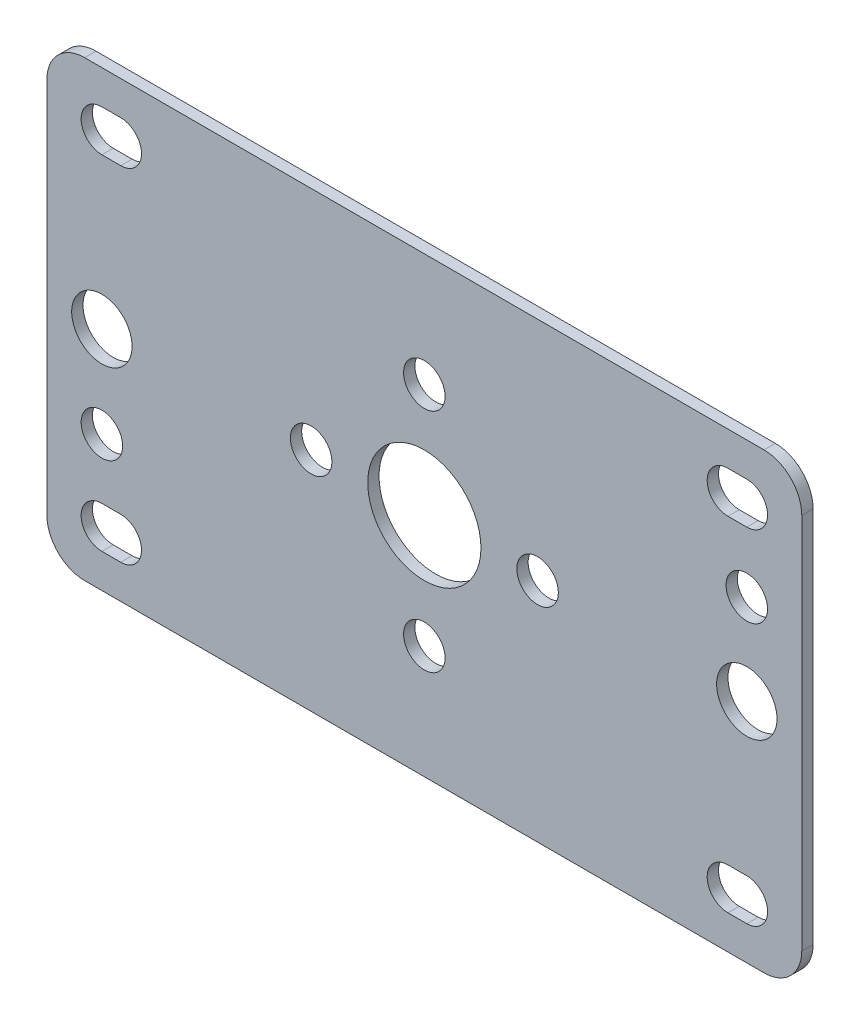
ISO-10303-21;
HEADER;
FILE_DESCRIPTION(('STEP AP214'),'2;1');
FILE_NAME('part.step','',(''),(''),'','','');
FILE_SCHEMA(('AUTOMOTIVE_DESIGN { 1 0 10303 214 1 1 1 1 }'));
ENDSEC;
DATA;
#1=APPLICATION_CONTEXT('core data for automotive mechanical design processes');
#2=APPLICATION_PROTOCOL_DEFINITION('international standard','automotive_design',2000,#1);
#3=PRODUCT_CONTEXT('',#1,'mechanical');
#4=PRODUCT('Part','Part','',(#3));
#5=PRODUCT_RELATED_PRODUCT_CATEGORY('part','',(#4));
#6=PRODUCT_DEFINITION_FORMATION('','',#4);
#7=PRODUCT_DEFINITION_CONTEXT('part definition',#1,'design');
#8=PRODUCT_DEFINITION('design','',#6,#7);
#9=PRODUCT_DEFINITION_SHAPE('','',#8);
#10=(LENGTH_UNIT() NAMED_UNIT(*) SI_UNIT(.MILLI.,.METRE.));
#11=(NAMED_UNIT(*) PLANE_ANGLE_UNIT() SI_UNIT($,.RADIAN.));
#12=(NAMED_UNIT(*) SI_UNIT($,.STERADIAN.) SOLID_ANGLE_UNIT());
#13=UNCERTAINTY_MEASURE_WITH_UNIT(LENGTH_MEASURE(1.E-05),#10,'distance_accuracy_value','');
#14=(GEOMETRIC_REPRESENTATION_CONTEXT(3) GLOBAL_UNCERTAINTY_ASSIGNED_CONTEXT((#13)) GLOBAL_UNIT_ASSIGNED_CONTEXT((#10,
#11,#12)) REPRESENTATION_CONTEXT('',''));
#15=CARTESIAN_POINT('',(0.,0.,0.));
#16=DIRECTION('',(0.,0.,1.));
#17=DIRECTION('',(1.,0.,0.));
#18=AXIS2_PLACEMENT_3D('',#15,#16,#17);
#19=CARTESIAN_POINT('',(0.,0.,0.));
#20=DIRECTION('',(0.,0.,1.));
#21=DIRECTION('',(1.,0.,0.));
#22=AXIS2_PLACEMENT_3D('',#19,#20,#21);
#23=PLANE('',#22);
#24=CARTESIAN_POINT('',(42.72,-22.75,0.));
#25=DIRECTION('',(0.,0.,1.));
#26=DIRECTION('',(1.,0.,0.));
#27=AXIS2_PLACEMENT_3D('',#24,#25,#26);
#28=CIRCLE('',#27,2.75);
#29=CARTESIAN_POINT('',(42.72,-20.,0.));
#30=VERTEX_POINT('',#29);
#31=CARTESIAN_POINT('',(42.72,-25.5,0.));
#32=VERTEX_POINT('',#31);
#33=EDGE_CURVE('E201',#30,#32,#28,.F.);
#34=ORIENTED_EDGE('',*,*,#33,.T.);
#35=DIRECTION('',(1.,0.,0.));
#36=VECTOR('',#35,1.);
#37=CARTESIAN_POINT('',(42.72,-25.5,0.));
#38=LINE('',#37,#36);
#39=CARTESIAN_POINT('',(40.22,-25.5,0.));
#40=VERTEX_POINT('',#39);
#41=EDGE_CURVE('E203',#40,#32,#38,.T.);
#42=ORIENTED_EDGE('',*,*,#41,.F.);
#43=CARTESIAN_POINT('',(40.22,-22.75,0.));
#44=DIRECTION('',(0.,0.,1.));
#45=DIRECTION('',(1.,0.,0.));
#46=AXIS2_PLACEMENT_3D('',#43,#44,#45);
#47=CIRCLE('',#46,2.75);
#48=CARTESIAN_POINT('',(40.22,-20.,0.));
#49=VERTEX_POINT('',#48);
#50=EDGE_CURVE('E205',#40,#49,#47,.F.);
#51=ORIENTED_EDGE('',*,*,#50,.T.);
#52=DIRECTION('',(1.,0.,0.));
#53=VECTOR('',#52,1.);
#54=CARTESIAN_POINT('',(40.22,-20.,0.));
#55=LINE('',#54,#53);
#56=EDGE_CURVE('E198',#30,#49,#55,.F.);
#57=ORIENTED_EDGE('',*,*,#56,.F.);
#58=EDGE_LOOP('',(#34,#42,#51,#57));
#59=FACE_BOUND('',#58,.T.);
#60=DIRECTION('',(1.,0.,0.));
#61=VECTOR('',#60,1.);
#62=CARTESIAN_POINT('',(-40.22,-25.5,0.));
#63=LINE('',#62,#61);
#64=CARTESIAN_POINT('',(-42.72,-25.5,0.));
#65=VERTEX_POINT('',#64);
#66=CARTESIAN_POINT('',(-40.22,-25.5,0.));
#67=VERTEX_POINT('',#66);
#68=EDGE_CURVE('E206',#65,#67,#63,.T.);
#69=ORIENTED_EDGE('',*,*,#68,.F.);
#70=CARTESIAN_POINT('',(-42.72,-22.75,0.));
#71=DIRECTION('',(0.,0.,1.));
#72=DIRECTION('',(1.,0.,0.));
#73=AXIS2_PLACEMENT_3D('',#70,#71,#72);
#74=CIRCLE('',#73,2.75);
#75=CARTESIAN_POINT('',(-42.72,-20.,0.));
#76=VERTEX_POINT('',#75);
#77=EDGE_CURVE('E321',#65,#76,#74,.F.);
#78=ORIENTED_EDGE('',*,*,#77,.T.);
#79=DIRECTION('',(1.,0.,0.));
#80=VECTOR('',#79,1.);
#81=CARTESIAN_POINT('',(-42.72,-20.,0.));
#82=LINE('',#81,#80);
#83=CARTESIAN_POINT('',(-40.22,-20.,0.));
#84=VERTEX_POINT('',#83);
#85=EDGE_CURVE('E210',#84,#76,#82,.F.);
#86=ORIENTED_EDGE('',*,*,#85,.F.);
#87=CARTESIAN_POINT('',(-40.22,-22.75,0.));
#88=DIRECTION('',(0.,0.,1.));
#89=DIRECTION('',(1.,0.,0.));
#90=AXIS2_PLACEMENT_3D('',#87,#88,#89);
#91=CIRCLE('',#90,2.75);
#92=EDGE_CURVE('E213',#84,#67,#91,.F.);
#93=ORIENTED_EDGE('',*,*,#92,.T.);
#94=EDGE_LOOP('',(#69,#78,#86,#93));
#95=FACE_BOUND('',#94,.T.);
#96=CARTESIAN_POINT('',(-42.72,22.75,0.));
#97=DIRECTION('',(0.,0.,1.));
#98=DIRECTION('',(1.,0.,0.));
#99=AXIS2_PLACEMENT_3D('',#96,#97,#98);
#100=CIRCLE('',#99,2.75);
#101=CARTESIAN_POINT('',(-42.72,20.,0.));
#102=VERTEX_POINT('',#101);
#103=CARTESIAN_POINT('',(-42.72,25.5,0.));
#104=VERTEX_POINT('',#103);
#105=EDGE_CURVE('E218',#102,#104,#100,.F.);
#106=ORIENTED_EDGE('',*,*,#105,.T.);
#107=DIRECTION('',(1.,0.,0.));
#108=VECTOR('',#107,1.);
#109=CARTESIAN_POINT('',(-42.72,25.5,0.));
#110=LINE('',#109,#108);
#111=CARTESIAN_POINT('',(-40.22,25.5,0.));
#112=VERTEX_POINT('',#111);
#113=EDGE_CURVE('E220',#112,#104,#110,.F.);
#114=ORIENTED_EDGE('',*,*,#113,.F.);
#115=CARTESIAN_POINT('',(-40.22,22.75,0.));
#116=DIRECTION('',(0.,0.,1.));
#117=DIRECTION('',(1.,0.,0.));
#118=AXIS2_PLACEMENT_3D('',#115,#116,#117);
#119=CIRCLE('',#118,2.75);
#120=CARTESIAN_POINT('',(-40.22,20.,0.));
#121=VERTEX_POINT('',#120);
#122=EDGE_CURVE('E222',#112,#121,#119,.F.);
#123=ORIENTED_EDGE('',*,*,#122,.T.);
#124=DIRECTION('',(1.,0.,0.));
#125=VECTOR('',#124,1.);
#126=CARTESIAN_POINT('',(-40.22,20.,0.));
#127=LINE('',#126,#125);
#128=EDGE_CURVE('E215',#102,#121,#127,.T.);
#129=ORIENTED_EDGE('',*,*,#128,.F.);
#130=EDGE_LOOP('',(#106,#114,#123,#129));
#131=FACE_BOUND('',#130,.T.);
#132=DIRECTION('',(1.,0.,0.));
#133=VECTOR('',#132,1.);
#134=CARTESIAN_POINT('',(40.22,25.5,0.));
#135=LINE('',#134,#133);
#136=CARTESIAN_POINT('',(42.72,25.5,0.));
#137=VERTEX_POINT('',#136);
#138=CARTESIAN_POINT('',(40.22,25.5,0.));
#139=VERTEX_POINT('',#138);
#140=EDGE_CURVE('E223',#137,#139,#135,.F.);
#141=ORIENTED_EDGE('',*,*,#140,.F.);
#142=CARTESIAN_POINT('',(42.72,22.75,0.));
#143=DIRECTION('',(0.,0.,1.));
#144=DIRECTION('',(1.,0.,0.));
#145=AXIS2_PLACEMENT_3D('',#142,#143,#144);
#146=CIRCLE('',#145,2.75);
#147=CARTESIAN_POINT('',(42.72,20.,0.));
#148=VERTEX_POINT('',#147);
#149=EDGE_CURVE('E331',#137,#148,#146,.F.);
#150=ORIENTED_EDGE('',*,*,#149,.T.);
#151=DIRECTION('',(1.,0.,0.));
#152=VECTOR('',#151,1.);
#153=CARTESIAN_POINT('',(42.72,20.,0.));
#154=LINE('',#153,#152);
#155=CARTESIAN_POINT('',(40.22,20.,0.));
#156=VERTEX_POINT('',#155);
#157=EDGE_CURVE('E227',#156,#148,#154,.T.);
#158=ORIENTED_EDGE('',*,*,#157,.F.);
#159=CARTESIAN_POINT('',(40.22,22.75,0.));
#160=DIRECTION('',(0.,0.,1.));
#161=DIRECTION('',(1.,0.,0.));
#162=AXIS2_PLACEMENT_3D('',#159,#160,#161);
#163=CIRCLE('',#162,2.75);
#164=EDGE_CURVE('E229',#156,#139,#163,.F.);
#165=ORIENTED_EDGE('',*,*,#164,.T.);
#166=EDGE_LOOP('',(#141,#150,#158,#165));
#167=FACE_BOUND('',#166,.T.);
#168=CARTESIAN_POINT('',(42.72,0.,0.));
#169=DIRECTION('',(0.,0.,1.));
#170=DIRECTION('',(1.,0.,0.));
#171=AXIS2_PLACEMENT_3D('',#168,#169,#170);
#172=CIRCLE('',#171,4.);
#173=CARTESIAN_POINT('',(46.72,0.,0.));
#174=VERTEX_POINT('',#173);
#175=EDGE_CURVE('E333',#174,#174,#172,.F.);
#176=ORIENTED_EDGE('',*,*,#175,.T.);
#177=EDGE_LOOP('',(#176));
#178=FACE_BOUND('',#177,.T.);
#179=CARTESIAN_POINT('',(0.,0.,0.));
#180=DIRECTION('',(0.,0.,1.));
#181=DIRECTION('',(1.,0.,0.));
#182=AXIS2_PLACEMENT_3D('',#179,#180,#181);
#183=CIRCLE('',#182,7.5);
#184=CARTESIAN_POINT('',(7.5,0.,0.));
#185=VERTEX_POINT('',#184);
#186=EDGE_CURVE('E336',#185,#185,#183,.F.);
#187=ORIENTED_EDGE('',*,*,#186,.T.);
#188=EDGE_LOOP('',(#187));
#189=FACE_BOUND('',#188,.T.);
#190=CARTESIAN_POINT('',(0.,-15.,0.));
#191=DIRECTION('',(0.,0.,1.));
#192=DIRECTION('',(1.,0.,0.));
#193=AXIS2_PLACEMENT_3D('',#190,#191,#192);
#194=CIRCLE('',#193,2.75);
#195=CARTESIAN_POINT('',(2.75,-15.,0.));
#196=VERTEX_POINT('',#195);
#197=EDGE_CURVE('E339',#196,#196,#194,.F.);
#198=ORIENTED_EDGE('',*,*,#197,.T.);
#199=EDGE_LOOP('',(#198));
#200=FACE_BOUND('',#199,.T.);
#201=CARTESIAN_POINT('',(-15.,0.,0.));
#202=DIRECTION('',(0.,0.,1.));
#203=DIRECTION('',(1.,0.,0.));
#204=AXIS2_PLACEMENT_3D('',#201,#202,#203);
#205=CIRCLE('',#204,2.75);
#206=CARTESIAN_POINT('',(-12.25,0.,0.));
#207=VERTEX_POINT('',#206);
#208=EDGE_CURVE('E342',#207,#207,#205,.F.);
#209=ORIENTED_EDGE('',*,*,#208,.T.);
#210=EDGE_LOOP('',(#209));
#211=FACE_BOUND('',#210,.T.);
#212=CARTESIAN_POINT('',(0.,15.,0.));
#213=DIRECTION('',(0.,0.,1.));
#214=DIRECTION('',(1.,0.,0.));
#215=AXIS2_PLACEMENT_3D('',#212,#213,#214);
#216=CIRCLE('',#215,2.75);
#217=CARTESIAN_POINT('',(2.75000000000001,15.,0.));
#218=VERTEX_POINT('',#217);
#219=EDGE_CURVE('E345',#218,#218,#216,.F.);
#220=ORIENTED_EDGE('',*,*,#219,.T.);
#221=EDGE_LOOP('',(#220));
#222=FACE_BOUND('',#221,.T.);
#223=CARTESIAN_POINT('',(15.,0.,0.));
#224=DIRECTION('',(0.,0.,1.));
#225=DIRECTION('',(1.,0.,0.));
#226=AXIS2_PLACEMENT_3D('',#223,#224,#225);
#227=CIRCLE('',#226,2.75);
#228=CARTESIAN_POINT('',(17.75,0.,0.));
#229=VERTEX_POINT('',#228);
#230=EDGE_CURVE('E348',#229,#229,#227,.F.);
#231=ORIENTED_EDGE('',*,*,#230,.T.);
#232=EDGE_LOOP('',(#231));
#233=FACE_BOUND('',#232,.T.);
#234=CARTESIAN_POINT('',(-42.72,-12.05,0.));
#235=DIRECTION('',(0.,0.,1.));
#236=DIRECTION('',(1.,0.,0.));
#237=AXIS2_PLACEMENT_3D('',#234,#235,#236);
#238=CIRCLE('',#237,2.75);
#239=CARTESIAN_POINT('',(-39.97,-12.05,0.));
#240=VERTEX_POINT('',#239);
#241=EDGE_CURVE('E351',#240,#240,#238,.F.);
#242=ORIENTED_EDGE('',*,*,#241,.T.);
#243=EDGE_LOOP('',(#242));
#244=FACE_BOUND('',#243,.T.);
#245=CARTESIAN_POINT('',(42.72,11.97,0.));
#246=DIRECTION('',(0.,0.,1.));
#247=DIRECTION('',(1.,0.,0.));
#248=AXIS2_PLACEMENT_3D('',#245,#246,#247);
#249=CIRCLE('',#248,2.75);
#250=CARTESIAN_POINT('',(45.47,11.97,0.));
#251=VERTEX_POINT('',#250);
#252=EDGE_CURVE('E354',#251,#251,#249,.F.);
#253=ORIENTED_EDGE('',*,*,#252,.T.);
#254=EDGE_LOOP('',(#253));
#255=FACE_BOUND('',#254,.T.);
#256=CARTESIAN_POINT('',(-42.72,0.,0.));
#257=DIRECTION('',(0.,0.,1.));
#258=DIRECTION('',(1.,0.,0.));
#259=AXIS2_PLACEMENT_3D('',#256,#257,#258);
#260=CIRCLE('',#259,4.);
#261=CARTESIAN_POINT('',(-38.72,0.,0.));
#262=VERTEX_POINT('',#261);
#263=EDGE_CURVE('E357',#262,#262,#260,.F.);
#264=ORIENTED_EDGE('',*,*,#263,.T.);
#265=EDGE_LOOP('',(#264));
#266=FACE_BOUND('',#265,.T.);
#267=CARTESIAN_POINT('',(45.,25.,0.));
#268=DIRECTION('',(0.,0.,1.));
#269=DIRECTION('',(1.,0.,0.));
#270=AXIS2_PLACEMENT_3D('',#267,#268,#269);
#271=CIRCLE('',#270,5.);
#272=CARTESIAN_POINT('',(45.,30.,0.));
#273=VERTEX_POINT('',#272);
#274=CARTESIAN_POINT('',(50.,25.,0.));
#275=VERTEX_POINT('',#274);
#276=EDGE_CURVE('E178',#273,#275,#271,.F.);
#277=ORIENTED_EDGE('',*,*,#276,.F.);
#278=DIRECTION('',(1.,0.,0.));
#279=VECTOR('',#278,1.);
#280=CARTESIAN_POINT('',(45.,30.,0.));
#281=LINE('',#280,#279);
#282=CARTESIAN_POINT('',(-45.,30.,0.));
#283=VERTEX_POINT('',#282);
#284=EDGE_CURVE('E176',#283,#273,#281,.T.);
#285=ORIENTED_EDGE('',*,*,#284,.F.);
#286=CARTESIAN_POINT('',(-45.,25.,0.));
#287=DIRECTION('',(0.,0.,1.));
#288=DIRECTION('',(1.,0.,0.));
#289=AXIS2_PLACEMENT_3D('',#286,#287,#288);
#290=CIRCLE('',#289,5.);
#291=CARTESIAN_POINT('',(-50.,25.,0.));
#292=VERTEX_POINT('',#291);
#293=EDGE_CURVE('E20',#292,#283,#290,.F.);
#294=ORIENTED_EDGE('',*,*,#293,.F.);
#295=DIRECTION('',(0.,1.,0.));
#296=VECTOR('',#295,1.);
#297=CARTESIAN_POINT('',(-50.,25.,0.));
#298=LINE('',#297,#296);
#299=CARTESIAN_POINT('',(-50.,-25.,0.));
#300=VERTEX_POINT('',#299);
#301=EDGE_CURVE('E242',#300,#292,#298,.T.);
#302=ORIENTED_EDGE('',*,*,#301,.F.);
#303=CARTESIAN_POINT('',(-45.,-25.,0.));
#304=DIRECTION('',(0.,0.,1.));
#305=DIRECTION('',(1.,0.,0.));
#306=AXIS2_PLACEMENT_3D('',#303,#304,#305);
#307=CIRCLE('',#306,5.);
#308=CARTESIAN_POINT('',(-45.,-30.,0.));
#309=VERTEX_POINT('',#308);
#310=EDGE_CURVE('E364',#309,#300,#307,.F.);
#311=ORIENTED_EDGE('',*,*,#310,.F.);
#312=DIRECTION('',(1.,0.,0.));
#313=VECTOR('',#312,1.);
#314=CARTESIAN_POINT('',(-45.,-30.,0.));
#315=LINE('',#314,#313);
#316=CARTESIAN_POINT('',(45.,-30.,0.));
#317=VERTEX_POINT('',#316);
#318=EDGE_CURVE('E237',#317,#309,#315,.F.);
#319=ORIENTED_EDGE('',*,*,#318,.F.);
#320=CARTESIAN_POINT('',(45.,-25.,0.));
#321=DIRECTION('',(0.,0.,1.));
#322=DIRECTION('',(1.,0.,0.));
#323=AXIS2_PLACEMENT_3D('',#320,#321,#322);
#324=CIRCLE('',#323,5.);
#325=CARTESIAN_POINT('',(50.,-25.,0.));
#326=VERTEX_POINT('',#325);
#327=EDGE_CURVE('E362',#326,#317,#324,.F.);
#328=ORIENTED_EDGE('',*,*,#327,.F.);
#329=DIRECTION('',(0.,1.,0.));
#330=VECTOR('',#329,1.);
#331=CARTESIAN_POINT('',(50.,-25.,0.));
#332=LINE('',#331,#330);
#333=EDGE_CURVE('E232',#275,#326,#332,.F.);
#334=ORIENTED_EDGE('',*,*,#333,.F.);
#335=EDGE_LOOP('',(#277,#285,#294,#302,#311,#319,#328,#334));
#336=FACE_BOUND('',#335,.T.);
#337=ADVANCED_FACE('F17',(#59,#95,#131,#167,#178,#189,#200,#211,#222,#233,#244,#255,#266,#336),
#23,.T.);
#338=CARTESIAN_POINT('',(45.,30.,0.));
#339=DIRECTION('',(0.,1.,0.));
#340=DIRECTION('',(0.,0.,1.));
#341=AXIS2_PLACEMENT_3D('',#338,#339,#340);
#342=PLANE('',#341);
#343=DIRECTION('',(0.,0.,1.));
#344=VECTOR('',#343,1.);
#345=CARTESIAN_POINT('',(-45.,30.,0.));
#346=LINE('',#345,#344);
#347=CARTESIAN_POINT('',(-45.,30.,-1.5));
#348=VERTEX_POINT('',#347);
#349=EDGE_CURVE('E183',#283,#348,#346,.F.);
#350=ORIENTED_EDGE('',*,*,#349,.F.);
#351=ORIENTED_EDGE('',*,*,#284,.T.);
#352=DIRECTION('',(0.,0.,1.));
#353=VECTOR('',#352,1.);
#354=CARTESIAN_POINT('',(45.,30.,0.));
#355=LINE('',#354,#353);
#356=CARTESIAN_POINT('',(45.,30.,-1.5));
#357=VERTEX_POINT('',#356);
#358=EDGE_CURVE('E361',#357,#273,#355,.T.);
#359=ORIENTED_EDGE('',*,*,#358,.F.);
#360=DIRECTION('',(1.,0.,0.));
#361=VECTOR('',#360,1.);
#362=CARTESIAN_POINT('',(0.,30.,-1.5));
#363=LINE('',#362,#361);
#364=EDGE_CURVE('E193',#357,#348,#363,.F.);
#365=ORIENTED_EDGE('',*,*,#364,.T.);
#366=EDGE_LOOP('',(#350,#351,#359,#365));
#367=FACE_BOUND('',#366,.T.);
#368=ADVANCED_FACE('F192',(#367),#342,.T.);
#369=CARTESIAN_POINT('',(-45.,25.,0.));
#370=DIRECTION('',(0.,0.,1.));
#371=DIRECTION('',(1.,0.,0.));
#372=AXIS2_PLACEMENT_3D('',#369,#370,#371);
#373=CYLINDRICAL_SURFACE('',#372,5.);
#374=DIRECTION('',(0.,0.,1.));
#375=VECTOR('',#374,1.);
#376=CARTESIAN_POINT('',(-50.,25.,0.));
#377=LINE('',#376,#375);
#378=CARTESIAN_POINT('',(-50.,25.,-1.5));
#379=VERTEX_POINT('',#378);
#380=EDGE_CURVE('E190',#292,#379,#377,.F.);
#381=ORIENTED_EDGE('',*,*,#380,.F.);
#382=ORIENTED_EDGE('',*,*,#293,.T.);
#383=ORIENTED_EDGE('',*,*,#349,.T.);
#384=CARTESIAN_POINT('',(-45.,25.,-1.5));
#385=DIRECTION('',(0.,0.,1.));
#386=DIRECTION('',(1.,0.,0.));
#387=AXIS2_PLACEMENT_3D('',#384,#385,#386);
#388=CIRCLE('',#387,5.);
#389=EDGE_CURVE('E312',#348,#379,#388,.T.);
#390=ORIENTED_EDGE('',*,*,#389,.T.);
#391=EDGE_LOOP('',(#381,#382,#383,#390));
#392=FACE_BOUND('',#391,.T.);
#393=ADVANCED_FACE('F187',(#392),#373,.T.);
#394=CARTESIAN_POINT('',(-50.,25.,0.));
#395=DIRECTION('',(-1.,0.,0.));
#396=DIRECTION('',(0.,0.,1.));
#397=AXIS2_PLACEMENT_3D('',#394,#395,#396);
#398=PLANE('',#397);
#399=DIRECTION('',(0.,0.,1.));
#400=VECTOR('',#399,1.);
#401=CARTESIAN_POINT('',(-50.,-25.,0.));
#402=LINE('',#401,#400);
#403=CARTESIAN_POINT('',(-50.,-25.,-1.5));
#404=VERTEX_POINT('',#403);
#405=EDGE_CURVE('E243',#300,#404,#402,.F.);
#406=ORIENTED_EDGE('',*,*,#405,.F.);
#407=ORIENTED_EDGE('',*,*,#301,.T.);
#408=ORIENTED_EDGE('',*,*,#380,.T.);
#409=DIRECTION('',(0.,1.,0.));
#410=VECTOR('',#409,1.);
#411=CARTESIAN_POINT('',(-50.,0.,-1.5));
#412=LINE('',#411,#410);
#413=EDGE_CURVE('E311',#379,#404,#412,.F.);
#414=ORIENTED_EDGE('',*,*,#413,.T.);
#415=EDGE_LOOP('',(#406,#407,#408,#414));
#416=FACE_BOUND('',#415,.T.);
#417=ADVANCED_FACE('F557',(#416),#398,.T.);
#418=CARTESIAN_POINT('',(-45.,-25.,0.));
#419=DIRECTION('',(0.,0.,1.));
#420=DIRECTION('',(1.,0.,0.));
#421=AXIS2_PLACEMENT_3D('',#418,#419,#420);
#422=CYLINDRICAL_SURFACE('',#421,5.);
#423=DIRECTION('',(0.,0.,-1.));
#424=VECTOR('',#423,1.);
#425=CARTESIAN_POINT('',(-45.,-30.,0.));
#426=LINE('',#425,#424);
#427=CARTESIAN_POINT('',(-45.,-30.,-1.5));
#428=VERTEX_POINT('',#427);
#429=EDGE_CURVE('E241',#309,#428,#426,.T.);
#430=ORIENTED_EDGE('',*,*,#429,.F.);
#431=ORIENTED_EDGE('',*,*,#310,.T.);
#432=ORIENTED_EDGE('',*,*,#405,.T.);
#433=CARTESIAN_POINT('',(-45.,-25.,-1.5));
#434=DIRECTION('',(0.,0.,1.));
#435=DIRECTION('',(1.,0.,0.));
#436=AXIS2_PLACEMENT_3D('',#433,#434,#435);
#437=CIRCLE('',#436,5.);
#438=EDGE_CURVE('E308',#404,#428,#437,.T.);
#439=ORIENTED_EDGE('',*,*,#438,.T.);
#440=EDGE_LOOP('',(#430,#431,#432,#439));
#441=FACE_BOUND('',#440,.T.);
#442=ADVANCED_FACE('F553',(#441),#422,.T.);
#443=CARTESIAN_POINT('',(-45.,-30.,0.));
#444=DIRECTION('',(0.,-1.,0.));
#445=DIRECTION('',(0.,0.,-1.));
#446=AXIS2_PLACEMENT_3D('',#443,#444,#445);
#447=PLANE('',#446);
#448=DIRECTION('',(0.,0.,1.));
#449=VECTOR('',#448,1.);
#450=CARTESIAN_POINT('',(45.,-30.,0.));
#451=LINE('',#450,#449);
#452=CARTESIAN_POINT('',(45.,-30.,-1.5));
#453=VERTEX_POINT('',#452);
#454=EDGE_CURVE('E240',#317,#453,#451,.F.);
#455=ORIENTED_EDGE('',*,*,#454,.F.);
#456=ORIENTED_EDGE('',*,*,#318,.T.);
#457=ORIENTED_EDGE('',*,*,#429,.T.);
#458=DIRECTION('',(1.,0.,0.));
#459=VECTOR('',#458,1.);
#460=CARTESIAN_POINT('',(0.,-30.,-1.5));
#461=LINE('',#460,#459);
#462=EDGE_CURVE('E307',#428,#453,#461,.T.);
#463=ORIENTED_EDGE('',*,*,#462,.T.);
#464=EDGE_LOOP('',(#455,#456,#457,#463));
#465=FACE_BOUND('',#464,.T.);
#466=ADVANCED_FACE('F549',(#465),#447,.T.);
#467=CARTESIAN_POINT('',(45.,-25.,0.));
#468=DIRECTION('',(0.,0.,1.));
#469=DIRECTION('',(1.,0.,0.));
#470=AXIS2_PLACEMENT_3D('',#467,#468,#469);
#471=CYLINDRICAL_SURFACE('',#470,5.);
#472=DIRECTION('',(0.,0.,-1.));
#473=VECTOR('',#472,1.);
#474=CARTESIAN_POINT('',(50.,-25.,0.));
#475=LINE('',#474,#473);
#476=CARTESIAN_POINT('',(50.,-25.,-1.5));
#477=VERTEX_POINT('',#476);
#478=EDGE_CURVE('E236',#326,#477,#475,.T.);
#479=ORIENTED_EDGE('',*,*,#478,.F.);
#480=ORIENTED_EDGE('',*,*,#327,.T.);
#481=ORIENTED_EDGE('',*,*,#454,.T.);
#482=CARTESIAN_POINT('',(45.,-25.,-1.5));
#483=DIRECTION('',(0.,0.,1.));
#484=DIRECTION('',(1.,0.,0.));
#485=AXIS2_PLACEMENT_3D('',#482,#483,#484);
#486=CIRCLE('',#485,5.);
#487=EDGE_CURVE('E304',#453,#477,#486,.T.);
#488=ORIENTED_EDGE('',*,*,#487,.T.);
#489=EDGE_LOOP('',(#479,#480,#481,#488));
#490=FACE_BOUND('',#489,.T.);
#491=ADVANCED_FACE('F545',(#490),#471,.T.);
#492=CARTESIAN_POINT('',(50.,-25.,0.));
#493=DIRECTION('',(1.,0.,0.));
#494=DIRECTION('',(0.,0.,-1.));
#495=AXIS2_PLACEMENT_3D('',#492,#493,#494);
#496=PLANE('',#495);
#497=DIRECTION('',(0.,0.,1.));
#498=VECTOR('',#497,1.);
#499=CARTESIAN_POINT('',(50.,25.,0.));
#500=LINE('',#499,#498);
#501=CARTESIAN_POINT('',(50.,25.,-1.5));
#502=VERTEX_POINT('',#501);
#503=EDGE_CURVE('E235',#275,#502,#500,.F.);
#504=ORIENTED_EDGE('',*,*,#503,.F.);
#505=ORIENTED_EDGE('',*,*,#333,.T.);
#506=ORIENTED_EDGE('',*,*,#478,.T.);
#507=DIRECTION('',(0.,1.,0.));
#508=VECTOR('',#507,1.);
#509=CARTESIAN_POINT('',(50.,0.,-1.5));
#510=LINE('',#509,#508);
#511=EDGE_CURVE('E303',#477,#502,#510,.T.);
#512=ORIENTED_EDGE('',*,*,#511,.T.);
#513=EDGE_LOOP('',(#504,#505,#506,#512));
#514=FACE_BOUND('',#513,.T.);
#515=ADVANCED_FACE('F541',(#514),#496,.T.);
#516=CARTESIAN_POINT('',(45.,25.,0.));
#517=DIRECTION('',(0.,0.,1.));
#518=DIRECTION('',(1.,0.,0.));
#519=AXIS2_PLACEMENT_3D('',#516,#517,#518);
#520=CYLINDRICAL_SURFACE('',#519,5.);
#521=ORIENTED_EDGE('',*,*,#358,.T.);
#522=ORIENTED_EDGE('',*,*,#276,.T.);
#523=ORIENTED_EDGE('',*,*,#503,.T.);
#524=CARTESIAN_POINT('',(45.,25.,-1.5));
#525=DIRECTION('',(0.,0.,1.));
#526=DIRECTION('',(1.,0.,0.));
#527=AXIS2_PLACEMENT_3D('',#524,#525,#526);
#528=CIRCLE('',#527,5.);
#529=EDGE_CURVE('E300',#502,#357,#528,.T.);
#530=ORIENTED_EDGE('',*,*,#529,.T.);
#531=EDGE_LOOP('',(#521,#522,#523,#530));
#532=FACE_BOUND('',#531,.T.);
#533=ADVANCED_FACE('F537',(#532),#520,.T.);
#534=CARTESIAN_POINT('',(-42.72,0.,0.));
#535=DIRECTION('',(0.,0.,1.));
#536=DIRECTION('',(1.,0.,0.));
#537=AXIS2_PLACEMENT_3D('',#534,#535,#536);
#538=CYLINDRICAL_SURFACE('',#537,4.);
#539=CARTESIAN_POINT('',(-42.72,0.,-1.5));
#540=DIRECTION('',(0.,0.,1.));
#541=DIRECTION('',(1.,0.,0.));
#542=AXIS2_PLACEMENT_3D('',#539,#540,#541);
#543=CIRCLE('',#542,4.);
#544=CARTESIAN_POINT('',(-38.72,0.,-1.5));
#545=VERTEX_POINT('',#544);
#546=EDGE_CURVE('E297',#545,#545,#543,.F.);
#547=ORIENTED_EDGE('',*,*,#546,.T.);
#548=EDGE_LOOP('',(#547));
#549=FACE_BOUND('',#548,.T.);
#550=ORIENTED_EDGE('',*,*,#263,.F.);
#551=EDGE_LOOP('',(#550));
#552=FACE_BOUND('',#551,.T.);
#553=ADVANCED_FACE('F533',(#549,#552),#538,.F.);
#554=CARTESIAN_POINT('',(42.72,11.97,0.));
#555=DIRECTION('',(0.,0.,1.));
#556=DIRECTION('',(1.,0.,0.));
#557=AXIS2_PLACEMENT_3D('',#554,#555,#556);
#558=CYLINDRICAL_SURFACE('',#557,2.75);
#559=CARTESIAN_POINT('',(42.72,11.97,-1.5));
#560=DIRECTION('',(0.,0.,1.));
#561=DIRECTION('',(1.,0.,0.));
#562=AXIS2_PLACEMENT_3D('',#559,#560,#561);
#563=CIRCLE('',#562,2.75);
#564=CARTESIAN_POINT('',(45.47,11.97,-1.5));
#565=VERTEX_POINT('',#564);
#566=EDGE_CURVE('E294',#565,#565,#563,.F.);
#567=ORIENTED_EDGE('',*,*,#566,.T.);
#568=EDGE_LOOP('',(#567));
#569=FACE_BOUND('',#568,.T.);
#570=ORIENTED_EDGE('',*,*,#252,.F.);
#571=EDGE_LOOP('',(#570));
#572=FACE_BOUND('',#571,.T.);
#573=ADVANCED_FACE('F529',(#569,#572),#558,.F.);
#574=CARTESIAN_POINT('',(-42.72,-12.05,0.));
#575=DIRECTION('',(0.,0.,1.));
#576=DIRECTION('',(1.,0.,0.));
#577=AXIS2_PLACEMENT_3D('',#574,#575,#576);
#578=CYLINDRICAL_SURFACE('',#577,2.75);
#579=CARTESIAN_POINT('',(-42.72,-12.05,-1.5));
#580=DIRECTION('',(0.,0.,1.));
#581=DIRECTION('',(1.,0.,0.));
#582=AXIS2_PLACEMENT_3D('',#579,#580,#581);
#583=CIRCLE('',#582,2.75);
#584=CARTESIAN_POINT('',(-39.97,-12.05,-1.5));
#585=VERTEX_POINT('',#584);
#586=EDGE_CURVE('E291',#585,#585,#583,.F.);
#587=ORIENTED_EDGE('',*,*,#586,.T.);
#588=EDGE_LOOP('',(#587));
#589=FACE_BOUND('',#588,.T.);
#590=ORIENTED_EDGE('',*,*,#241,.F.);
#591=EDGE_LOOP('',(#590));
#592=FACE_BOUND('',#591,.T.);
#593=ADVANCED_FACE('F525',(#589,#592),#578,.F.);
#594=CARTESIAN_POINT('',(15.,0.,0.));
#595=DIRECTION('',(0.,0.,1.));
#596=DIRECTION('',(1.,0.,0.));
#597=AXIS2_PLACEMENT_3D('',#594,#595,#596);
#598=CYLINDRICAL_SURFACE('',#597,2.75);
#599=CARTESIAN_POINT('',(15.,0.,-1.5));
#600=DIRECTION('',(0.,0.,1.));
#601=DIRECTION('',(1.,0.,0.));
#602=AXIS2_PLACEMENT_3D('',#599,#600,#601);
#603=CIRCLE('',#602,2.75);
#604=CARTESIAN_POINT('',(17.75,0.,-1.5));
#605=VERTEX_POINT('',#604);
#606=EDGE_CURVE('E288',#605,#605,#603,.F.);
#607=ORIENTED_EDGE('',*,*,#606,.T.);
#608=EDGE_LOOP('',(#607));
#609=FACE_BOUND('',#608,.T.);
#610=ORIENTED_EDGE('',*,*,#230,.F.);
#611=EDGE_LOOP('',(#610));
#612=FACE_BOUND('',#611,.T.);
#613=ADVANCED_FACE('F521',(#609,#612),#598,.F.);
#614=CARTESIAN_POINT('',(0.,15.,0.));
#615=DIRECTION('',(0.,0.,1.));
#616=DIRECTION('',(1.,0.,0.));
#617=AXIS2_PLACEMENT_3D('',#614,#615,#616);
#618=CYLINDRICAL_SURFACE('',#617,2.75);
#619=CARTESIAN_POINT('',(0.,15.,-1.5));
#620=DIRECTION('',(0.,0.,1.));
#621=DIRECTION('',(1.,0.,0.));
#622=AXIS2_PLACEMENT_3D('',#619,#620,#621);
#623=CIRCLE('',#622,2.75);
#624=CARTESIAN_POINT('',(2.75000000000001,15.,-1.5));
#625=VERTEX_POINT('',#624);
#626=EDGE_CURVE('E285',#625,#625,#623,.F.);
#627=ORIENTED_EDGE('',*,*,#626,.T.);
#628=EDGE_LOOP('',(#627));
#629=FACE_BOUND('',#628,.T.);
#630=ORIENTED_EDGE('',*,*,#219,.F.);
#631=EDGE_LOOP('',(#630));
#632=FACE_BOUND('',#631,.T.);
#633=ADVANCED_FACE('F517',(#629,#632),#618,.F.);
#634=CARTESIAN_POINT('',(-15.,0.,0.));
#635=DIRECTION('',(0.,0.,1.));
#636=DIRECTION('',(1.,0.,0.));
#637=AXIS2_PLACEMENT_3D('',#634,#635,#636);
#638=CYLINDRICAL_SURFACE('',#637,2.75);
#639=CARTESIAN_POINT('',(-15.,0.,-1.5));
#640=DIRECTION('',(0.,0.,1.));
#641=DIRECTION('',(1.,0.,0.));
#642=AXIS2_PLACEMENT_3D('',#639,#640,#641);
#643=CIRCLE('',#642,2.75);
#644=CARTESIAN_POINT('',(-12.25,0.,-1.5));
#645=VERTEX_POINT('',#644);
#646=EDGE_CURVE('E282',#645,#645,#643,.F.);
#647=ORIENTED_EDGE('',*,*,#646,.T.);
#648=EDGE_LOOP('',(#647));
#649=FACE_BOUND('',#648,.T.);
#650=ORIENTED_EDGE('',*,*,#208,.F.);
#651=EDGE_LOOP('',(#650));
#652=FACE_BOUND('',#651,.T.);
#653=ADVANCED_FACE('F513',(#649,#652),#638,.F.);
#654=CARTESIAN_POINT('',(0.,-15.,0.));
#655=DIRECTION('',(0.,0.,1.));
#656=DIRECTION('',(1.,0.,0.));
#657=AXIS2_PLACEMENT_3D('',#654,#655,#656);
#658=CYLINDRICAL_SURFACE('',#657,2.75);
#659=CARTESIAN_POINT('',(0.,-15.,-1.5));
#660=DIRECTION('',(0.,0.,1.));
#661=DIRECTION('',(1.,0.,0.));
#662=AXIS2_PLACEMENT_3D('',#659,#660,#661);
#663=CIRCLE('',#662,2.75);
#664=CARTESIAN_POINT('',(2.75,-15.,-1.5));
#665=VERTEX_POINT('',#664);
#666=EDGE_CURVE('E279',#665,#665,#663,.F.);
#667=ORIENTED_EDGE('',*,*,#666,.T.);
#668=EDGE_LOOP('',(#667));
#669=FACE_BOUND('',#668,.T.);
#670=ORIENTED_EDGE('',*,*,#197,.F.);
#671=EDGE_LOOP('',(#670));
#672=FACE_BOUND('',#671,.T.);
#673=ADVANCED_FACE('F509',(#669,#672),#658,.F.);
#674=CARTESIAN_POINT('',(0.,0.,0.));
#675=DIRECTION('',(0.,0.,1.));
#676=DIRECTION('',(1.,0.,0.));
#677=AXIS2_PLACEMENT_3D('',#674,#675,#676);
#678=CYLINDRICAL_SURFACE('',#677,7.5);
#679=CARTESIAN_POINT('',(0.,0.,-1.5));
#680=DIRECTION('',(0.,0.,1.));
#681=DIRECTION('',(1.,0.,0.));
#682=AXIS2_PLACEMENT_3D('',#679,#680,#681);
#683=CIRCLE('',#682,7.5);
#684=CARTESIAN_POINT('',(7.5,0.,-1.5));
#685=VERTEX_POINT('',#684);
#686=EDGE_CURVE('E276',#685,#685,#683,.F.);
#687=ORIENTED_EDGE('',*,*,#686,.T.);
#688=EDGE_LOOP('',(#687));
#689=FACE_BOUND('',#688,.T.);
#690=ORIENTED_EDGE('',*,*,#186,.F.);
#691=EDGE_LOOP('',(#690));
#692=FACE_BOUND('',#691,.T.);
#693=ADVANCED_FACE('F505',(#689,#692),#678,.F.);
#694=CARTESIAN_POINT('',(42.72,0.,0.));
#695=DIRECTION('',(0.,0.,1.));
#696=DIRECTION('',(1.,0.,0.));
#697=AXIS2_PLACEMENT_3D('',#694,#695,#696);
#698=CYLINDRICAL_SURFACE('',#697,4.);
#699=CARTESIAN_POINT('',(42.72,0.,-1.5));
#700=DIRECTION('',(0.,0.,1.));
#701=DIRECTION('',(1.,0.,0.));
#702=AXIS2_PLACEMENT_3D('',#699,#700,#701);
#703=CIRCLE('',#702,4.);
#704=CARTESIAN_POINT('',(46.72,0.,-1.5));
#705=VERTEX_POINT('',#704);
#706=EDGE_CURVE('E273',#705,#705,#703,.F.);
#707=ORIENTED_EDGE('',*,*,#706,.T.);
#708=EDGE_LOOP('',(#707));
#709=FACE_BOUND('',#708,.T.);
#710=ORIENTED_EDGE('',*,*,#175,.F.);
#711=EDGE_LOOP('',(#710));
#712=FACE_BOUND('',#711,.T.);
#713=ADVANCED_FACE('F501',(#709,#712),#698,.F.);
#714=CARTESIAN_POINT('',(42.72,22.75,0.));
#715=DIRECTION('',(0.,0.,1.));
#716=DIRECTION('',(1.,0.,0.));
#717=AXIS2_PLACEMENT_3D('',#714,#715,#716);
#718=CYLINDRICAL_SURFACE('',#717,2.75);
#719=CARTESIAN_POINT('',(42.72,22.75,-1.5));
#720=DIRECTION('',(0.,0.,1.));
#721=DIRECTION('',(1.,0.,0.));
#722=AXIS2_PLACEMENT_3D('',#719,#720,#721);
#723=CIRCLE('',#722,2.75);
#724=CARTESIAN_POINT('',(42.72,25.5,-1.5));
#725=VERTEX_POINT('',#724);
#726=CARTESIAN_POINT('',(42.72,20.,-1.5));
#727=VERTEX_POINT('',#726);
#728=EDGE_CURVE('E270',#725,#727,#723,.F.);
#729=ORIENTED_EDGE('',*,*,#728,.T.);
#730=DIRECTION('',(0.,0.,1.));
#731=VECTOR('',#730,1.);
#732=CARTESIAN_POINT('',(42.72,20.,0.));
#733=LINE('',#732,#731);
#734=EDGE_CURVE('E230',#148,#727,#733,.F.);
#735=ORIENTED_EDGE('',*,*,#734,.F.);
#736=ORIENTED_EDGE('',*,*,#149,.F.);
#737=DIRECTION('',(0.,0.,-1.));
#738=VECTOR('',#737,1.);
#739=CARTESIAN_POINT('',(42.72,25.5,0.));
#740=LINE('',#739,#738);
#741=EDGE_CURVE('E226',#725,#137,#740,.F.);
#742=ORIENTED_EDGE('',*,*,#741,.F.);
#743=EDGE_LOOP('',(#729,#735,#736,#742));
#744=FACE_BOUND('',#743,.T.);
#745=ADVANCED_FACE('F497',(#744),#718,.F.);
#746=CARTESIAN_POINT('',(42.72,20.,0.));
#747=DIRECTION('',(0.,1.,0.));
#748=DIRECTION('',(0.,0.,1.));
#749=AXIS2_PLACEMENT_3D('',#746,#747,#748);
#750=PLANE('',#749);
#751=DIRECTION('',(0.,0.,1.));
#752=VECTOR('',#751,1.);
#753=CARTESIAN_POINT('',(40.22,20.,0.));
#754=LINE('',#753,#752);
#755=CARTESIAN_POINT('',(40.22,20.,-1.5));
#756=VERTEX_POINT('',#755);
#757=EDGE_CURVE('E330',#756,#156,#754,.T.);
#758=ORIENTED_EDGE('',*,*,#757,.T.);
#759=ORIENTED_EDGE('',*,*,#157,.T.);
#760=ORIENTED_EDGE('',*,*,#734,.T.);
#761=DIRECTION('',(1.,0.,0.));
#762=VECTOR('',#761,1.);
#763=CARTESIAN_POINT('',(0.,20.,-1.5));
#764=LINE('',#763,#762);
#765=EDGE_CURVE('E269',#727,#756,#764,.F.);
#766=ORIENTED_EDGE('',*,*,#765,.T.);
#767=EDGE_LOOP('',(#758,#759,#760,#766));
#768=FACE_BOUND('',#767,.T.);
#769=ADVANCED_FACE('F493',(#768),#750,.T.);
#770=CARTESIAN_POINT('',(40.22,22.75,0.));
#771=DIRECTION('',(0.,0.,1.));
#772=DIRECTION('',(1.,0.,0.));
#773=AXIS2_PLACEMENT_3D('',#770,#771,#772);
#774=CYLINDRICAL_SURFACE('',#773,2.75);
#775=CARTESIAN_POINT('',(40.22,22.75,-1.5));
#776=DIRECTION('',(0.,0.,1.));
#777=DIRECTION('',(1.,0.,0.));
#778=AXIS2_PLACEMENT_3D('',#775,#776,#777);
#779=CIRCLE('',#778,2.75);
#780=CARTESIAN_POINT('',(40.22,25.5,-1.5));
#781=VERTEX_POINT('',#780);
#782=EDGE_CURVE('E265',#756,#781,#779,.F.);
#783=ORIENTED_EDGE('',*,*,#782,.T.);
#784=DIRECTION('',(0.,0.,-1.));
#785=VECTOR('',#784,1.);
#786=CARTESIAN_POINT('',(40.22,25.5,0.));
#787=LINE('',#786,#785);
#788=EDGE_CURVE('E379',#139,#781,#787,.T.);
#789=ORIENTED_EDGE('',*,*,#788,.F.);
#790=ORIENTED_EDGE('',*,*,#164,.F.);
#791=ORIENTED_EDGE('',*,*,#757,.F.);
#792=EDGE_LOOP('',(#783,#789,#790,#791));
#793=FACE_BOUND('',#792,.T.);
#794=ADVANCED_FACE('F489',(#793),#774,.F.);
#795=CARTESIAN_POINT('',(40.22,25.5,0.));
#796=DIRECTION('',(0.,-1.,0.));
#797=DIRECTION('',(0.,0.,-1.));
#798=AXIS2_PLACEMENT_3D('',#795,#796,#797);
#799=PLANE('',#798);
#800=ORIENTED_EDGE('',*,*,#741,.T.);
#801=ORIENTED_EDGE('',*,*,#140,.T.);
#802=ORIENTED_EDGE('',*,*,#788,.T.);
#803=DIRECTION('',(1.,0.,0.));
#804=VECTOR('',#803,1.);
#805=CARTESIAN_POINT('',(0.,25.5,-1.5));
#806=LINE('',#805,#804);
#807=EDGE_CURVE('E268',#781,#725,#806,.T.);
#808=ORIENTED_EDGE('',*,*,#807,.T.);
#809=EDGE_LOOP('',(#800,#801,#802,#808));
#810=FACE_BOUND('',#809,.T.);
#811=ADVANCED_FACE('F485',(#810),#799,.T.);
#812=CARTESIAN_POINT('',(-42.72,25.5,0.));
#813=DIRECTION('',(0.,-1.,0.));
#814=DIRECTION('',(0.,0.,-1.));
#815=AXIS2_PLACEMENT_3D('',#812,#813,#814);
#816=PLANE('',#815);
#817=DIRECTION('',(0.,0.,1.));
#818=VECTOR('',#817,1.);
#819=CARTESIAN_POINT('',(-40.22,25.5,0.));
#820=LINE('',#819,#818);
#821=CARTESIAN_POINT('',(-40.22,25.5,-1.5));
#822=VERTEX_POINT('',#821);
#823=EDGE_CURVE('E328',#822,#112,#820,.T.);
#824=ORIENTED_EDGE('',*,*,#823,.T.);
#825=ORIENTED_EDGE('',*,*,#113,.T.);
#826=DIRECTION('',(0.,0.,1.));
#827=VECTOR('',#826,1.);
#828=CARTESIAN_POINT('',(-42.72,25.5,0.));
#829=LINE('',#828,#827);
#830=CARTESIAN_POINT('',(-42.72,25.5,-1.5));
#831=VERTEX_POINT('',#830);
#832=EDGE_CURVE('E326',#104,#831,#829,.F.);
#833=ORIENTED_EDGE('',*,*,#832,.T.);
#834=DIRECTION('',(1.,0.,0.));
#835=VECTOR('',#834,1.);
#836=CARTESIAN_POINT('',(0.,25.5,-1.5));
#837=LINE('',#836,#835);
#838=EDGE_CURVE('E264',#831,#822,#837,.T.);
#839=ORIENTED_EDGE('',*,*,#838,.T.);
#840=EDGE_LOOP('',(#824,#825,#833,#839));
#841=FACE_BOUND('',#840,.T.);
#842=ADVANCED_FACE('F481',(#841),#816,.T.);
#843=CARTESIAN_POINT('',(-40.22,22.75,0.));
#844=DIRECTION('',(0.,0.,1.));
#845=DIRECTION('',(1.,0.,0.));
#846=AXIS2_PLACEMENT_3D('',#843,#844,#845);
#847=CYLINDRICAL_SURFACE('',#846,2.75);
#848=CARTESIAN_POINT('',(-40.22,22.75,-1.5));
#849=DIRECTION('',(0.,0.,1.));
#850=DIRECTION('',(1.,0.,0.));
#851=AXIS2_PLACEMENT_3D('',#848,#849,#850);
#852=CIRCLE('',#851,2.75);
#853=CARTESIAN_POINT('',(-40.22,20.,-1.5));
#854=VERTEX_POINT('',#853);
#855=EDGE_CURVE('E261',#822,#854,#852,.F.);
#856=ORIENTED_EDGE('',*,*,#855,.T.);
#857=DIRECTION('',(0.,0.,1.));
#858=VECTOR('',#857,1.);
#859=CARTESIAN_POINT('',(-40.22,20.,0.));
#860=LINE('',#859,#858);
#861=EDGE_CURVE('E219',#121,#854,#860,.F.);
#862=ORIENTED_EDGE('',*,*,#861,.F.);
#863=ORIENTED_EDGE('',*,*,#122,.F.);
#864=ORIENTED_EDGE('',*,*,#823,.F.);
#865=EDGE_LOOP('',(#856,#862,#863,#864));
#866=FACE_BOUND('',#865,.T.);
#867=ADVANCED_FACE('F477',(#866),#847,.F.);
#868=CARTESIAN_POINT('',(-40.22,20.,0.));
#869=DIRECTION('',(0.,1.,0.));
#870=DIRECTION('',(0.,0.,1.));
#871=AXIS2_PLACEMENT_3D('',#868,#869,#870);
#872=PLANE('',#871);
#873=DIRECTION('',(0.,0.,1.));
#874=VECTOR('',#873,1.);
#875=CARTESIAN_POINT('',(-42.72,20.,0.));
#876=LINE('',#875,#874);
#877=CARTESIAN_POINT('',(-42.72,20.,-1.5));
#878=VERTEX_POINT('',#877);
#879=EDGE_CURVE('E323',#878,#102,#876,.T.);
#880=ORIENTED_EDGE('',*,*,#879,.T.);
#881=ORIENTED_EDGE('',*,*,#128,.T.);
#882=ORIENTED_EDGE('',*,*,#861,.T.);
#883=DIRECTION('',(1.,0.,0.));
#884=VECTOR('',#883,1.);
#885=CARTESIAN_POINT('',(0.,20.,-1.5));
#886=LINE('',#885,#884);
#887=EDGE_CURVE('E260',#854,#878,#886,.F.);
#888=ORIENTED_EDGE('',*,*,#887,.T.);
#889=EDGE_LOOP('',(#880,#881,#882,#888));
#890=FACE_BOUND('',#889,.T.);
#891=ADVANCED_FACE('F473',(#890),#872,.T.);
#892=CARTESIAN_POINT('',(-42.72,22.75,0.));
#893=DIRECTION('',(0.,0.,1.));
#894=DIRECTION('',(1.,0.,0.));
#895=AXIS2_PLACEMENT_3D('',#892,#893,#894);
#896=CYLINDRICAL_SURFACE('',#895,2.75);
#897=CARTESIAN_POINT('',(-42.72,22.75,-1.5));
#898=DIRECTION('',(0.,0.,1.));
#899=DIRECTION('',(1.,0.,0.));
#900=AXIS2_PLACEMENT_3D('',#897,#898,#899);
#901=CIRCLE('',#900,2.75);
#902=EDGE_CURVE('E257',#878,#831,#901,.F.);
#903=ORIENTED_EDGE('',*,*,#902,.T.);
#904=ORIENTED_EDGE('',*,*,#832,.F.);
#905=ORIENTED_EDGE('',*,*,#105,.F.);
#906=ORIENTED_EDGE('',*,*,#879,.F.);
#907=EDGE_LOOP('',(#903,#904,#905,#906));
#908=FACE_BOUND('',#907,.T.);
#909=ADVANCED_FACE('F469',(#908),#896,.F.);
#910=CARTESIAN_POINT('',(-42.72,-22.75,0.));
#911=DIRECTION('',(0.,0.,1.));
#912=DIRECTION('',(1.,0.,0.));
#913=AXIS2_PLACEMENT_3D('',#910,#911,#912);
#914=CYLINDRICAL_SURFACE('',#913,2.75);
#915=CARTESIAN_POINT('',(-42.72,-22.75,-1.5));
#916=DIRECTION('',(0.,0.,1.));
#917=DIRECTION('',(1.,0.,0.));
#918=AXIS2_PLACEMENT_3D('',#915,#916,#917);
#919=CIRCLE('',#918,2.75);
#920=CARTESIAN_POINT('',(-42.72,-25.5,-1.5));
#921=VERTEX_POINT('',#920);
#922=CARTESIAN_POINT('',(-42.72,-20.,-1.5));
#923=VERTEX_POINT('',#922);
#924=EDGE_CURVE('E254',#921,#923,#919,.F.);
#925=ORIENTED_EDGE('',*,*,#924,.T.);
#926=DIRECTION('',(0.,0.,-1.));
#927=VECTOR('',#926,1.);
#928=CARTESIAN_POINT('',(-42.72,-20.,0.));
#929=LINE('',#928,#927);
#930=EDGE_CURVE('E214',#76,#923,#929,.T.);
#931=ORIENTED_EDGE('',*,*,#930,.F.);
#932=ORIENTED_EDGE('',*,*,#77,.F.);
#933=DIRECTION('',(0.,0.,1.));
#934=VECTOR('',#933,1.);
#935=CARTESIAN_POINT('',(-42.72,-25.5,0.));
#936=LINE('',#935,#934);
#937=EDGE_CURVE('E209',#921,#65,#936,.T.);
#938=ORIENTED_EDGE('',*,*,#937,.F.);
#939=EDGE_LOOP('',(#925,#931,#932,#938));
#940=FACE_BOUND('',#939,.T.);
#941=ADVANCED_FACE('F465',(#940),#914,.F.);
#942=CARTESIAN_POINT('',(-42.72,-20.,0.));
#943=DIRECTION('',(0.,-1.,0.));
#944=DIRECTION('',(0.,0.,-1.));
#945=AXIS2_PLACEMENT_3D('',#942,#943,#944);
#946=PLANE('',#945);
#947=DIRECTION('',(0.,0.,1.));
#948=VECTOR('',#947,1.);
#949=CARTESIAN_POINT('',(-40.22,-20.,0.));
#950=LINE('',#949,#948);
#951=CARTESIAN_POINT('',(-40.22,-20.,-1.5));
#952=VERTEX_POINT('',#951);
#953=EDGE_CURVE('E320',#952,#84,#950,.T.);
#954=ORIENTED_EDGE('',*,*,#953,.T.);
#955=ORIENTED_EDGE('',*,*,#85,.T.);
#956=ORIENTED_EDGE('',*,*,#930,.T.);
#957=DIRECTION('',(1.,0.,0.));
#958=VECTOR('',#957,1.);
#959=CARTESIAN_POINT('',(0.,-20.,-1.5));
#960=LINE('',#959,#958);
#961=EDGE_CURVE('E253',#923,#952,#960,.T.);
#962=ORIENTED_EDGE('',*,*,#961,.T.);
#963=EDGE_LOOP('',(#954,#955,#956,#962));
#964=FACE_BOUND('',#963,.T.);
#965=ADVANCED_FACE('F461',(#964),#946,.T.);
#966=CARTESIAN_POINT('',(-40.22,-22.75,0.));
#967=DIRECTION('',(0.,0.,1.));
#968=DIRECTION('',(1.,0.,0.));
#969=AXIS2_PLACEMENT_3D('',#966,#967,#968);
#970=CYLINDRICAL_SURFACE('',#969,2.75);
#971=CARTESIAN_POINT('',(-40.22,-22.75,-1.5));
#972=DIRECTION('',(0.,0.,1.));
#973=DIRECTION('',(1.,0.,0.));
#974=AXIS2_PLACEMENT_3D('',#971,#972,#973);
#975=CIRCLE('',#974,2.75);
#976=CARTESIAN_POINT('',(-40.22,-25.5,-1.5));
#977=VERTEX_POINT('',#976);
#978=EDGE_CURVE('E249',#952,#977,#975,.F.);
#979=ORIENTED_EDGE('',*,*,#978,.T.);
#980=DIRECTION('',(0.,0.,1.));
#981=VECTOR('',#980,1.);
#982=CARTESIAN_POINT('',(-40.22,-25.5,0.));
#983=LINE('',#982,#981);
#984=EDGE_CURVE('E393',#67,#977,#983,.F.);
#985=ORIENTED_EDGE('',*,*,#984,.F.);
#986=ORIENTED_EDGE('',*,*,#92,.F.);
#987=ORIENTED_EDGE('',*,*,#953,.F.);
#988=EDGE_LOOP('',(#979,#985,#986,#987));
#989=FACE_BOUND('',#988,.T.);
#990=ADVANCED_FACE('F457',(#989),#970,.F.);
#991=CARTESIAN_POINT('',(-40.22,-25.5,0.));
#992=DIRECTION('',(0.,1.,0.));
#993=DIRECTION('',(0.,0.,1.));
#994=AXIS2_PLACEMENT_3D('',#991,#992,#993);
#995=PLANE('',#994);
#996=ORIENTED_EDGE('',*,*,#937,.T.);
#997=ORIENTED_EDGE('',*,*,#68,.T.);
#998=ORIENTED_EDGE('',*,*,#984,.T.);
#999=DIRECTION('',(1.,0.,0.));
#1000=VECTOR('',#999,1.);
#1001=CARTESIAN_POINT('',(0.,-25.5,-1.5));
#1002=LINE('',#1001,#1000);
#1003=EDGE_CURVE('E252',#977,#921,#1002,.F.);
#1004=ORIENTED_EDGE('',*,*,#1003,.T.);
#1005=EDGE_LOOP('',(#996,#997,#998,#1004));
#1006=FACE_BOUND('',#1005,.T.);
#1007=ADVANCED_FACE('F454',(#1006),#995,.T.);
#1008=CARTESIAN_POINT('',(42.72,-25.5,0.));
#1009=DIRECTION('',(0.,1.,0.));
#1010=DIRECTION('',(0.,0.,1.));
#1011=AXIS2_PLACEMENT_3D('',#1008,#1009,#1010);
#1012=PLANE('',#1011);
#1013=DIRECTION('',(0.,0.,1.));
#1014=VECTOR('',#1013,1.);
#1015=CARTESIAN_POINT('',(40.22,-25.5,0.));
#1016=LINE('',#1015,#1014);
#1017=CARTESIAN_POINT('',(40.22,-25.5,-1.5));
#1018=VERTEX_POINT('',#1017);
#1019=EDGE_CURVE('E318',#1018,#40,#1016,.T.);
#1020=ORIENTED_EDGE('',*,*,#1019,.T.);
#1021=ORIENTED_EDGE('',*,*,#41,.T.);
#1022=DIRECTION('',(0.,0.,1.));
#1023=VECTOR('',#1022,1.);
#1024=CARTESIAN_POINT('',(42.72,-25.5,0.));
#1025=LINE('',#1024,#1023);
#1026=CARTESIAN_POINT('',(42.72,-25.5,-1.5));
#1027=VERTEX_POINT('',#1026);
#1028=EDGE_CURVE('E316',#32,#1027,#1025,.F.);
#1029=ORIENTED_EDGE('',*,*,#1028,.T.);
#1030=DIRECTION('',(1.,0.,0.));
#1031=VECTOR('',#1030,1.);
#1032=CARTESIAN_POINT('',(0.,-25.5,-1.5));
#1033=LINE('',#1032,#1031);
#1034=EDGE_CURVE('E248',#1027,#1018,#1033,.F.);
#1035=ORIENTED_EDGE('',*,*,#1034,.T.);
#1036=EDGE_LOOP('',(#1020,#1021,#1029,#1035));
#1037=FACE_BOUND('',#1036,.T.);
#1038=ADVANCED_FACE('F437',(#1037),#1012,.T.);
#1039=CARTESIAN_POINT('',(40.22,-22.75,0.));
#1040=DIRECTION('',(0.,0.,1.));
#1041=DIRECTION('',(1.,0.,0.));
#1042=AXIS2_PLACEMENT_3D('',#1039,#1040,#1041);
#1043=CYLINDRICAL_SURFACE('',#1042,2.75);
#1044=CARTESIAN_POINT('',(40.22,-22.75,-1.5));
#1045=DIRECTION('',(0.,0.,1.));
#1046=DIRECTION('',(1.,0.,0.));
#1047=AXIS2_PLACEMENT_3D('',#1044,#1045,#1046);
#1048=CIRCLE('',#1047,2.75);
#1049=CARTESIAN_POINT('',(40.22,-20.,-1.5));
#1050=VERTEX_POINT('',#1049);
#1051=EDGE_CURVE('E245',#1018,#1050,#1048,.F.);
#1052=ORIENTED_EDGE('',*,*,#1051,.T.);
#1053=DIRECTION('',(0.,0.,-1.));
#1054=VECTOR('',#1053,1.);
#1055=CARTESIAN_POINT('',(40.22,-20.,0.));
#1056=LINE('',#1055,#1054);
#1057=EDGE_CURVE('E202',#49,#1050,#1056,.T.);
#1058=ORIENTED_EDGE('',*,*,#1057,.F.);
#1059=ORIENTED_EDGE('',*,*,#50,.F.);
#1060=ORIENTED_EDGE('',*,*,#1019,.F.);
#1061=EDGE_LOOP('',(#1052,#1058,#1059,#1060));
#1062=FACE_BOUND('',#1061,.T.);
#1063=ADVANCED_FACE('F434',(#1062),#1043,.F.);
#1064=CARTESIAN_POINT('',(40.22,-20.,0.));
#1065=DIRECTION('',(0.,-1.,0.));
#1066=DIRECTION('',(0.,0.,-1.));
#1067=AXIS2_PLACEMENT_3D('',#1064,#1065,#1066);
#1068=PLANE('',#1067);
#1069=DIRECTION('',(0.,0.,1.));
#1070=VECTOR('',#1069,1.);
#1071=CARTESIAN_POINT('',(42.72,-20.,0.));
#1072=LINE('',#1071,#1070);
#1073=CARTESIAN_POINT('',(42.72,-20.,-1.5));
#1074=VERTEX_POINT('',#1073);
#1075=EDGE_CURVE('E34',#1074,#30,#1072,.T.);
#1076=ORIENTED_EDGE('',*,*,#1075,.T.);
#1077=ORIENTED_EDGE('',*,*,#56,.T.);
#1078=ORIENTED_EDGE('',*,*,#1057,.T.);
#1079=DIRECTION('',(1.,0.,0.));
#1080=VECTOR('',#1079,1.);
#1081=CARTESIAN_POINT('',(0.,-20.,-1.5));
#1082=LINE('',#1081,#1080);
#1083=EDGE_CURVE('E26',#1050,#1074,#1082,.T.);
#1084=ORIENTED_EDGE('',*,*,#1083,.T.);
#1085=EDGE_LOOP('',(#1076,#1077,#1078,#1084));
#1086=FACE_BOUND('',#1085,.T.);
#1087=ADVANCED_FACE('F427',(#1086),#1068,.T.);
#1088=CARTESIAN_POINT('',(42.72,-22.75,0.));
#1089=DIRECTION('',(0.,0.,1.));
#1090=DIRECTION('',(1.,0.,0.));
#1091=AXIS2_PLACEMENT_3D('',#1088,#1089,#1090);
#1092=CYLINDRICAL_SURFACE('',#1091,2.75);
#1093=CARTESIAN_POINT('',(42.72,-22.75,-1.5));
#1094=DIRECTION('',(0.,0.,1.));
#1095=DIRECTION('',(1.,0.,0.));
#1096=AXIS2_PLACEMENT_3D('',#1093,#1094,#1095);
#1097=CIRCLE('',#1096,2.75);
#1098=EDGE_CURVE('E11',#1074,#1027,#1097,.F.);
#1099=ORIENTED_EDGE('',*,*,#1098,.T.);
#1100=ORIENTED_EDGE('',*,*,#1028,.F.);
#1101=ORIENTED_EDGE('',*,*,#33,.F.);
#1102=ORIENTED_EDGE('',*,*,#1075,.F.);
#1103=EDGE_LOOP('',(#1099,#1100,#1101,#1102));
#1104=FACE_BOUND('',#1103,.T.);
#1105=ADVANCED_FACE('F439',(#1104),#1092,.F.);
#1106=CARTESIAN_POINT('',(0.,0.,-1.5));
#1107=DIRECTION('',(0.,0.,1.));
#1108=DIRECTION('',(1.,0.,0.));
#1109=AXIS2_PLACEMENT_3D('',#1106,#1107,#1108);
#1110=PLANE('',#1109);
#1111=ORIENTED_EDGE('',*,*,#1083,.F.);
#1112=ORIENTED_EDGE('',*,*,#1051,.F.);
#1113=ORIENTED_EDGE('',*,*,#1034,.F.);
#1114=ORIENTED_EDGE('',*,*,#1098,.F.);
#1115=EDGE_LOOP('',(#1111,#1112,#1113,#1114));
#1116=FACE_BOUND('',#1115,.T.);
#1117=ORIENTED_EDGE('',*,*,#978,.F.);
#1118=ORIENTED_EDGE('',*,*,#961,.F.);
#1119=ORIENTED_EDGE('',*,*,#924,.F.);
#1120=ORIENTED_EDGE('',*,*,#1003,.F.);
#1121=EDGE_LOOP('',(#1117,#1118,#1119,#1120));
#1122=FACE_BOUND('',#1121,.T.);
#1123=ORIENTED_EDGE('',*,*,#887,.F.);
#1124=ORIENTED_EDGE('',*,*,#855,.F.);
#1125=ORIENTED_EDGE('',*,*,#838,.F.);
#1126=ORIENTED_EDGE('',*,*,#902,.F.);
#1127=EDGE_LOOP('',(#1123,#1124,#1125,#1126));
#1128=FACE_BOUND('',#1127,.T.);
#1129=ORIENTED_EDGE('',*,*,#782,.F.);
#1130=ORIENTED_EDGE('',*,*,#765,.F.);
#1131=ORIENTED_EDGE('',*,*,#728,.F.);
#1132=ORIENTED_EDGE('',*,*,#807,.F.);
#1133=EDGE_LOOP('',(#1129,#1130,#1131,#1132));
#1134=FACE_BOUND('',#1133,.T.);
#1135=ORIENTED_EDGE('',*,*,#706,.F.);
#1136=EDGE_LOOP('',(#1135));
#1137=FACE_BOUND('',#1136,.T.);
#1138=ORIENTED_EDGE('',*,*,#686,.F.);
#1139=EDGE_LOOP('',(#1138));
#1140=FACE_BOUND('',#1139,.T.);
#1141=ORIENTED_EDGE('',*,*,#666,.F.);
#1142=EDGE_LOOP('',(#1141));
#1143=FACE_BOUND('',#1142,.T.);
#1144=ORIENTED_EDGE('',*,*,#646,.F.);
#1145=EDGE_LOOP('',(#1144));
#1146=FACE_BOUND('',#1145,.T.);
#1147=ORIENTED_EDGE('',*,*,#626,.F.);
#1148=EDGE_LOOP('',(#1147));
#1149=FACE_BOUND('',#1148,.T.);
#1150=ORIENTED_EDGE('',*,*,#606,.F.);
#1151=EDGE_LOOP('',(#1150));
#1152=FACE_BOUND('',#1151,.T.);
#1153=ORIENTED_EDGE('',*,*,#586,.F.);
#1154=EDGE_LOOP('',(#1153));
#1155=FACE_BOUND('',#1154,.T.);
#1156=ORIENTED_EDGE('',*,*,#566,.F.);
#1157=EDGE_LOOP('',(#1156));
#1158=FACE_BOUND('',#1157,.T.);
#1159=ORIENTED_EDGE('',*,*,#546,.F.);
#1160=EDGE_LOOP('',(#1159));
#1161=FACE_BOUND('',#1160,.T.);
#1162=ORIENTED_EDGE('',*,*,#511,.F.);
#1163=ORIENTED_EDGE('',*,*,#487,.F.);
#1164=ORIENTED_EDGE('',*,*,#462,.F.);
#1165=ORIENTED_EDGE('',*,*,#438,.F.);
#1166=ORIENTED_EDGE('',*,*,#413,.F.);
#1167=ORIENTED_EDGE('',*,*,#389,.F.);
#1168=ORIENTED_EDGE('',*,*,#364,.F.);
#1169=ORIENTED_EDGE('',*,*,#529,.F.);
#1170=EDGE_LOOP('',(#1162,#1163,#1164,#1165,#1166,#1167,#1168,#1169));
#1171=FACE_BOUND('',#1170,.T.);
#1172=ADVANCED_FACE('F431',(#1116,#1122,#1128,#1134,#1137,#1140,#1143,#1146,#1149,#1152,#1155,
#1158,#1161,#1171),#1110,.F.);
#1173=CLOSED_SHELL('',(#337,#368,#393,#417,#442,#466,#491,#515,#533,#553,#573,#593,#613,#633,
#653,#673,#693,#713,#745,#769,#794,#811,#842,#867,#891,#909,#941,#965,#990,#1007,#1038,#1063,
#1087,#1105,#1172));
#1174=MANIFOLD_SOLID_BREP('B1',#1173);
#1175=ADVANCED_BREP_SHAPE_REPRESENTATION('',(#18,#1174),#14);
#1176=SHAPE_DEFINITION_REPRESENTATION(#9,#1175);
ENDSEC;
END-ISO-10303-21;
